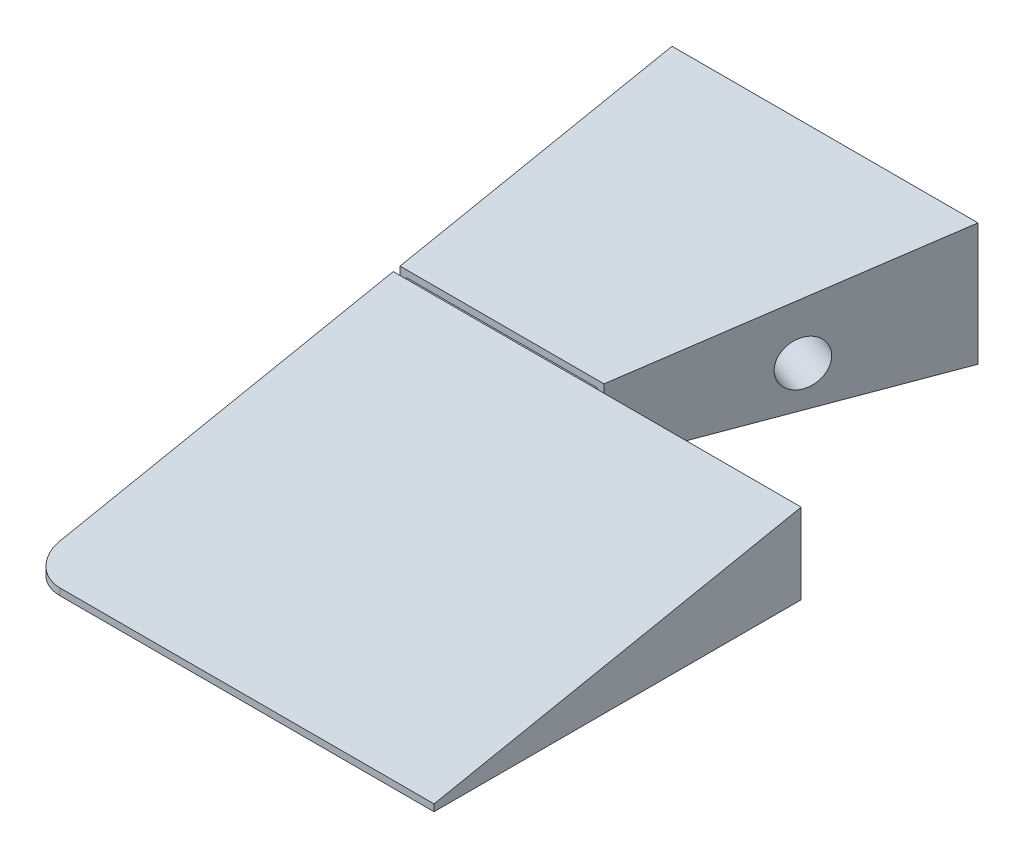
ISO-10303-21;
HEADER;
FILE_DESCRIPTION(('STEP AP214'),'2;1');
FILE_NAME('part.step','',(''),(''),'','','');
FILE_SCHEMA(('AUTOMOTIVE_DESIGN { 1 0 10303 214 1 1 1 1 }'));
ENDSEC;
DATA;
#1=APPLICATION_CONTEXT('core data for automotive mechanical design processes');
#2=APPLICATION_PROTOCOL_DEFINITION('international standard','automotive_design',2000,#1);
#3=PRODUCT_CONTEXT('',#1,'mechanical');
#4=PRODUCT('Part','Part','',(#3));
#5=PRODUCT_RELATED_PRODUCT_CATEGORY('part','',(#4));
#6=PRODUCT_DEFINITION_FORMATION('','',#4);
#7=PRODUCT_DEFINITION_CONTEXT('part definition',#1,'design');
#8=PRODUCT_DEFINITION('design','',#6,#7);
#9=PRODUCT_DEFINITION_SHAPE('','',#8);
#10=(LENGTH_UNIT() NAMED_UNIT(*) SI_UNIT(.MILLI.,.METRE.));
#11=(NAMED_UNIT(*) PLANE_ANGLE_UNIT() SI_UNIT($,.RADIAN.));
#12=(NAMED_UNIT(*) SI_UNIT($,.STERADIAN.) SOLID_ANGLE_UNIT());
#13=UNCERTAINTY_MEASURE_WITH_UNIT(LENGTH_MEASURE(1.E-05),#10,'distance_accuracy_value','');
#14=(GEOMETRIC_REPRESENTATION_CONTEXT(3) GLOBAL_UNCERTAINTY_ASSIGNED_CONTEXT((#13)) GLOBAL_UNIT_ASSIGNED_CONTEXT((#10,
#11,#12)) REPRESENTATION_CONTEXT('',''));
#15=CARTESIAN_POINT('',(0.,0.,0.));
#16=DIRECTION('',(0.,0.,1.));
#17=DIRECTION('',(1.,0.,0.));
#18=AXIS2_PLACEMENT_3D('',#15,#16,#17);
#19=CARTESIAN_POINT('',(-35.,-10.001,41.));
#20=DIRECTION('',(0.,0.,1.));
#21=DIRECTION('',(1.,0.,0.));
#22=AXIS2_PLACEMENT_3D('',#19,#20,#21);
#23=PLANE('',#22);
#24=DIRECTION('',(-1.,0.,0.));
#25=VECTOR('',#24,1.);
#26=CARTESIAN_POINT('',(-35.,-10.,41.));
#27=LINE('',#26,#25);
#28=CARTESIAN_POINT('',(-5.00000000000005,-10.,41.));
#29=VERTEX_POINT('',#28);
#30=CARTESIAN_POINT('',(-65.,-10.,41.));
#31=VERTEX_POINT('',#30);
#32=EDGE_CURVE('E228',#29,#31,#27,.T.);
#33=ORIENTED_EDGE('',*,*,#32,.T.);
#34=DIRECTION('',(0.,1.,0.));
#35=VECTOR('',#34,1.);
#36=CARTESIAN_POINT('',(-65.,1.8,41.));
#37=LINE('',#36,#35);
#38=CARTESIAN_POINT('',(-65.,1.8,41.));
#39=VERTEX_POINT('',#38);
#40=EDGE_CURVE('E185',#31,#39,#37,.T.);
#41=ORIENTED_EDGE('',*,*,#40,.T.);
#42=DIRECTION('',(-1.,0.,0.));
#43=VECTOR('',#42,1.);
#44=CARTESIAN_POINT('',(-35.,1.8,41.));
#45=LINE('',#44,#43);
#46=CARTESIAN_POINT('',(-5.00000000000005,1.8,41.));
#47=VERTEX_POINT('',#46);
#48=EDGE_CURVE('E237',#47,#39,#45,.T.);
#49=ORIENTED_EDGE('',*,*,#48,.F.);
#50=DIRECTION('',(0.,1.,0.));
#51=VECTOR('',#50,1.);
#52=CARTESIAN_POINT('',(-5.00000000000005,-10.001,41.));
#53=LINE('',#52,#51);
#54=EDGE_CURVE('E224',#29,#47,#53,.T.);
#55=ORIENTED_EDGE('',*,*,#54,.F.);
#56=EDGE_LOOP('',(#33,#41,#49,#55));
#57=FACE_BOUND('',#56,.T.);
#58=DIRECTION('',(0.,1.,0.));
#59=VECTOR('',#58,1.);
#60=CARTESIAN_POINT('',(-36.,1.00000000000001,41.));
#61=LINE('',#60,#59);
#62=CARTESIAN_POINT('',(-36.,-7.,41.));
#63=VERTEX_POINT('',#62);
#64=CARTESIAN_POINT('',(-36.,1.00000000000001,41.));
#65=VERTEX_POINT('',#64);
#66=EDGE_CURVE('E56',#63,#65,#61,.T.);
#67=ORIENTED_EDGE('',*,*,#66,.T.);
#68=DIRECTION('',(-1.,0.,0.));
#69=VECTOR('',#68,1.);
#70=CARTESIAN_POINT('',(-64.,1.00000000000001,41.));
#71=LINE('',#70,#69);
#72=CARTESIAN_POINT('',(-64.,1.00000000000001,41.));
#73=VERTEX_POINT('',#72);
#74=EDGE_CURVE('E208',#65,#73,#71,.T.);
#75=ORIENTED_EDGE('',*,*,#74,.T.);
#76=DIRECTION('',(0.,-1.,0.));
#77=VECTOR('',#76,1.);
#78=CARTESIAN_POINT('',(-64.,1.00000000000001,41.));
#79=LINE('',#78,#77);
#80=CARTESIAN_POINT('',(-64.,-7.,41.));
#81=VERTEX_POINT('',#80);
#82=EDGE_CURVE('E210',#73,#81,#79,.T.);
#83=ORIENTED_EDGE('',*,*,#82,.T.);
#84=DIRECTION('',(1.,0.,0.));
#85=VECTOR('',#84,1.);
#86=CARTESIAN_POINT('',(-64.,-7.,41.));
#87=LINE('',#86,#85);
#88=EDGE_CURVE('E162',#81,#63,#87,.T.);
#89=ORIENTED_EDGE('',*,*,#88,.T.);
#90=EDGE_LOOP('',(#67,#75,#83,#89));
#91=FACE_BOUND('',#90,.T.);
#92=ADVANCED_FACE('F34',(#57,#91),#23,.F.);
#93=CARTESIAN_POINT('',(-5.00000000000005,-10.001,41.));
#94=DIRECTION('',(-1.,0.,0.));
#95=DIRECTION('',(0.,0.,1.));
#96=AXIS2_PLACEMENT_3D('',#93,#94,#95);
#97=PLANE('',#96);
#98=DIRECTION('',(0.,0.196116135138184,-0.98058067569092));
#99=VECTOR('',#98,1.);
#100=CARTESIAN_POINT('',(-5.00000000000004,1.34611538461539,43.2694230769231));
#101=LINE('',#100,#99);
#102=CARTESIAN_POINT('',(-5.,-9.,95.));
#103=VERTEX_POINT('',#102);
#104=EDGE_CURVE('E216',#103,#47,#101,.T.);
#105=ORIENTED_EDGE('',*,*,#104,.F.);
#106=DIRECTION('',(0.,1.,0.));
#107=VECTOR('',#106,1.);
#108=CARTESIAN_POINT('',(-5.,-10.001,95.));
#109=LINE('',#108,#107);
#110=CARTESIAN_POINT('',(-5.,-10.,95.));
#111=VERTEX_POINT('',#110);
#112=EDGE_CURVE('E225',#111,#103,#109,.T.);
#113=ORIENTED_EDGE('',*,*,#112,.F.);
#114=DIRECTION('',(0.,0.,-1.));
#115=VECTOR('',#114,1.);
#116=CARTESIAN_POINT('',(-5.00000000000005,-10.,41.));
#117=LINE('',#116,#115);
#118=EDGE_CURVE('E221',#111,#29,#117,.T.);
#119=ORIENTED_EDGE('',*,*,#118,.T.);
#120=ORIENTED_EDGE('',*,*,#54,.T.);
#121=EDGE_LOOP('',(#105,#113,#119,#120));
#122=FACE_BOUND('',#121,.T.);
#123=ADVANCED_FACE('F270',(#122),#97,.F.);
#124=CARTESIAN_POINT('',(0.,0.,95.));
#125=DIRECTION('',(0.,0.,1.));
#126=DIRECTION('',(1.,0.,0.));
#127=AXIS2_PLACEMENT_3D('',#124,#125,#126);
#128=PLANE('',#127);
#129=DIRECTION('',(1.,0.,0.));
#130=VECTOR('',#129,1.);
#131=CARTESIAN_POINT('',(-263.908902631417,-9.,95.));
#132=LINE('',#131,#130);
#133=CARTESIAN_POINT('',(-60.,-9.,95.));
#134=VERTEX_POINT('',#133);
#135=EDGE_CURVE('E214',#134,#103,#132,.T.);
#136=ORIENTED_EDGE('',*,*,#135,.F.);
#137=DIRECTION('',(0.,-1.,0.));
#138=VECTOR('',#137,1.);
#139=CARTESIAN_POINT('',(-60.,-10.,95.));
#140=LINE('',#139,#138);
#141=CARTESIAN_POINT('',(-60.,-10.,95.));
#142=VERTEX_POINT('',#141);
#143=EDGE_CURVE('E240',#134,#142,#140,.T.);
#144=ORIENTED_EDGE('',*,*,#143,.T.);
#145=DIRECTION('',(1.,0.,0.));
#146=VECTOR('',#145,1.);
#147=CARTESIAN_POINT('',(-65.,-10.,95.));
#148=LINE('',#147,#146);
#149=EDGE_CURVE('E232',#142,#111,#148,.T.);
#150=ORIENTED_EDGE('',*,*,#149,.T.);
#151=ORIENTED_EDGE('',*,*,#112,.T.);
#152=EDGE_LOOP('',(#136,#144,#150,#151));
#153=FACE_BOUND('',#152,.T.);
#154=ADVANCED_FACE('F257',(#153),#128,.T.);
#155=CARTESIAN_POINT('',(-60.,0.,90.));
#156=DIRECTION('',(0.,1.,0.));
#157=DIRECTION('',(0.,0.,1.));
#158=AXIS2_PLACEMENT_3D('',#155,#156,#157);
#159=CYLINDRICAL_SURFACE('',#158,5.);
#160=CARTESIAN_POINT('',(-60.,-8.,90.));
#161=DIRECTION('',(0.,0.98058067569092,0.196116135138184));
#162=DIRECTION('',(0.,0.196116135138184,-0.98058067569092));
#163=AXIS2_PLACEMENT_3D('',#160,#161,#162);
#164=ELLIPSE('',#163,5.09901951359278,5.);
#165=CARTESIAN_POINT('',(-65.,-8.,90.));
#166=VERTEX_POINT('',#165);
#167=EDGE_CURVE('E42',#166,#134,#164,.T.);
#168=ORIENTED_EDGE('',*,*,#167,.F.);
#169=DIRECTION('',(0.,-1.,0.));
#170=VECTOR('',#169,1.);
#171=CARTESIAN_POINT('',(-65.,-9.,90.));
#172=LINE('',#171,#170);
#173=CARTESIAN_POINT('',(-65.,-10.,90.));
#174=VERTEX_POINT('',#173);
#175=EDGE_CURVE('E245',#174,#166,#172,.F.);
#176=ORIENTED_EDGE('',*,*,#175,.F.);
#177=CARTESIAN_POINT('',(-60.,-10.,90.));
#178=DIRECTION('',(0.,1.,0.));
#179=DIRECTION('',(0.,0.,1.));
#180=AXIS2_PLACEMENT_3D('',#177,#178,#179);
#181=CIRCLE('',#180,5.);
#182=EDGE_CURVE('E243',#142,#174,#181,.F.);
#183=ORIENTED_EDGE('',*,*,#182,.F.);
#184=ORIENTED_EDGE('',*,*,#143,.F.);
#185=EDGE_LOOP('',(#168,#176,#183,#184));
#186=FACE_BOUND('',#185,.T.);
#187=ADVANCED_FACE('F36',(#186),#159,.T.);
#188=CARTESIAN_POINT('',(-65.,-10.,95.));
#189=DIRECTION('',(0.,1.,0.));
#190=DIRECTION('',(0.,0.,1.));
#191=AXIS2_PLACEMENT_3D('',#188,#189,#190);
#192=PLANE('',#191);
#193=DIRECTION('',(0.,0.,-1.));
#194=VECTOR('',#193,1.);
#195=CARTESIAN_POINT('',(-65.,-10.,95.));
#196=LINE('',#195,#194);
#197=EDGE_CURVE('E234',#174,#31,#196,.T.);
#198=ORIENTED_EDGE('',*,*,#197,.T.);
#199=ORIENTED_EDGE('',*,*,#32,.F.);
#200=ORIENTED_EDGE('',*,*,#118,.F.);
#201=ORIENTED_EDGE('',*,*,#149,.F.);
#202=ORIENTED_EDGE('',*,*,#182,.T.);
#203=EDGE_LOOP('',(#198,#199,#200,#201,#202));
#204=FACE_BOUND('',#203,.T.);
#205=ADVANCED_FACE('F262',(#204),#192,.F.);
#206=CARTESIAN_POINT('',(-263.908902631417,10.,0.));
#207=DIRECTION('',(0.,0.98058067569092,0.196116135138184));
#208=DIRECTION('',(0.,-0.196116135138184,0.98058067569092));
#209=AXIS2_PLACEMENT_3D('',#206,#207,#208);
#210=PLANE('',#209);
#211=ORIENTED_EDGE('',*,*,#48,.T.);
#212=DIRECTION('',(0.,-0.196116135138184,0.98058067569092));
#213=VECTOR('',#212,1.);
#214=CARTESIAN_POINT('',(-65.,-8.26923076923077,91.3461538461538));
#215=LINE('',#214,#213);
#216=EDGE_CURVE('E219',#39,#166,#215,.T.);
#217=ORIENTED_EDGE('',*,*,#216,.T.);
#218=ORIENTED_EDGE('',*,*,#167,.T.);
#219=ORIENTED_EDGE('',*,*,#135,.T.);
#220=ORIENTED_EDGE('',*,*,#104,.T.);
#221=EDGE_LOOP('',(#211,#217,#218,#219,#220));
#222=FACE_BOUND('',#221,.T.);
#223=ADVANCED_FACE('F250',(#222),#210,.T.);
#224=CARTESIAN_POINT('',(-65.,10.,95.));
#225=DIRECTION('',(1.,0.,0.));
#226=DIRECTION('',(0.,0.,-1.));
#227=AXIS2_PLACEMENT_3D('',#224,#225,#226);
#228=PLANE('',#227);
#229=ORIENTED_EDGE('',*,*,#216,.F.);
#230=ORIENTED_EDGE('',*,*,#40,.F.);
#231=ORIENTED_EDGE('',*,*,#197,.F.);
#232=ORIENTED_EDGE('',*,*,#175,.T.);
#233=EDGE_LOOP('',(#229,#230,#231,#232));
#234=FACE_BOUND('',#233,.T.);
#235=ADVANCED_FACE('F267',(#234),#228,.F.);
#236=CARTESIAN_POINT('',(-36.,1.00000000000001,95.002));
#237=DIRECTION('',(-1.,0.,0.));
#238=DIRECTION('',(0.,0.,1.));
#239=AXIS2_PLACEMENT_3D('',#236,#237,#238);
#240=PLANE('',#239);
#241=ORIENTED_EDGE('',*,*,#66,.F.);
#242=DIRECTION('',(0.,0.,-1.));
#243=VECTOR('',#242,1.);
#244=CARTESIAN_POINT('',(-36.,-7.,95.002));
#245=LINE('',#244,#243);
#246=CARTESIAN_POINT('',(-36.,-7.,40.));
#247=VERTEX_POINT('',#246);
#248=EDGE_CURVE('E191',#63,#247,#245,.T.);
#249=ORIENTED_EDGE('',*,*,#248,.T.);
#250=DIRECTION('',(0.,1.,0.));
#251=VECTOR('',#250,1.);
#252=CARTESIAN_POINT('',(-36.,1.00000000000001,40.));
#253=LINE('',#252,#251);
#254=CARTESIAN_POINT('',(-36.,1.00000000000001,40.));
#255=VERTEX_POINT('',#254);
#256=EDGE_CURVE('E182',#247,#255,#253,.T.);
#257=ORIENTED_EDGE('',*,*,#256,.T.);
#258=DIRECTION('',(0.,0.,-1.));
#259=VECTOR('',#258,1.);
#260=CARTESIAN_POINT('',(-36.,1.00000000000001,95.002));
#261=LINE('',#260,#259);
#262=EDGE_CURVE('E196',#65,#255,#261,.T.);
#263=ORIENTED_EDGE('',*,*,#262,.F.);
#264=EDGE_LOOP('',(#241,#249,#257,#263));
#265=FACE_BOUND('',#264,.T.);
#266=ADVANCED_FACE('F284',(#265),#240,.F.);
#267=CARTESIAN_POINT('',(-64.,1.00000000000001,95.002));
#268=DIRECTION('',(0.,-1.,0.));
#269=DIRECTION('',(0.,0.,-1.));
#270=AXIS2_PLACEMENT_3D('',#267,#268,#269);
#271=PLANE('',#270);
#272=ORIENTED_EDGE('',*,*,#74,.F.);
#273=ORIENTED_EDGE('',*,*,#262,.T.);
#274=DIRECTION('',(-1.,0.,0.));
#275=VECTOR('',#274,1.);
#276=CARTESIAN_POINT('',(-64.,1.00000000000001,40.));
#277=LINE('',#276,#275);
#278=CARTESIAN_POINT('',(-64.,1.00000000000001,40.));
#279=VERTEX_POINT('',#278);
#280=EDGE_CURVE('E187',#255,#279,#277,.T.);
#281=ORIENTED_EDGE('',*,*,#280,.T.);
#282=DIRECTION('',(0.,0.,-1.));
#283=VECTOR('',#282,1.);
#284=CARTESIAN_POINT('',(-64.,1.00000000000001,95.002));
#285=LINE('',#284,#283);
#286=EDGE_CURVE('E199',#73,#279,#285,.T.);
#287=ORIENTED_EDGE('',*,*,#286,.F.);
#288=EDGE_LOOP('',(#272,#273,#281,#287));
#289=FACE_BOUND('',#288,.T.);
#290=ADVANCED_FACE('F290',(#289),#271,.F.);
#291=CARTESIAN_POINT('',(-64.,1.00000000000001,95.002));
#292=DIRECTION('',(1.,0.,0.));
#293=DIRECTION('',(0.,0.,-1.));
#294=AXIS2_PLACEMENT_3D('',#291,#292,#293);
#295=PLANE('',#294);
#296=ORIENTED_EDGE('',*,*,#82,.F.);
#297=ORIENTED_EDGE('',*,*,#286,.T.);
#298=DIRECTION('',(0.,-1.,0.));
#299=VECTOR('',#298,1.);
#300=CARTESIAN_POINT('',(-64.,1.00000000000001,40.));
#301=LINE('',#300,#299);
#302=CARTESIAN_POINT('',(-64.,-7.,40.));
#303=VERTEX_POINT('',#302);
#304=EDGE_CURVE('E190',#279,#303,#301,.T.);
#305=ORIENTED_EDGE('',*,*,#304,.T.);
#306=DIRECTION('',(0.,0.,-1.));
#307=VECTOR('',#306,1.);
#308=CARTESIAN_POINT('',(-64.,-7.,95.002));
#309=LINE('',#308,#307);
#310=EDGE_CURVE('E202',#81,#303,#309,.T.);
#311=ORIENTED_EDGE('',*,*,#310,.F.);
#312=EDGE_LOOP('',(#296,#297,#305,#311));
#313=FACE_BOUND('',#312,.T.);
#314=ADVANCED_FACE('F294',(#313),#295,.F.);
#315=CARTESIAN_POINT('',(-64.,-7.,95.002));
#316=DIRECTION('',(0.,1.,0.));
#317=DIRECTION('',(0.,0.,1.));
#318=AXIS2_PLACEMENT_3D('',#315,#316,#317);
#319=PLANE('',#318);
#320=ORIENTED_EDGE('',*,*,#88,.F.);
#321=ORIENTED_EDGE('',*,*,#310,.T.);
#322=DIRECTION('',(1.,0.,0.));
#323=VECTOR('',#322,1.);
#324=CARTESIAN_POINT('',(-64.,-7.,40.));
#325=LINE('',#324,#323);
#326=EDGE_CURVE('E186',#303,#247,#325,.T.);
#327=ORIENTED_EDGE('',*,*,#326,.T.);
#328=ORIENTED_EDGE('',*,*,#248,.F.);
#329=EDGE_LOOP('',(#320,#321,#327,#328));
#330=FACE_BOUND('',#329,.T.);
#331=ADVANCED_FACE('F285',(#330),#319,.F.);
#332=CARTESIAN_POINT('',(-65.,10.,95.));
#333=DIRECTION('',(1.,0.,0.));
#334=DIRECTION('',(0.,0.,-1.));
#335=AXIS2_PLACEMENT_3D('',#332,#333,#334);
#336=PLANE('',#335);
#337=CARTESIAN_POINT('',(-65.,-2.,20.));
#338=DIRECTION('',(-1.,0.,0.));
#339=DIRECTION('',(0.,0.,1.));
#340=AXIS2_PLACEMENT_3D('',#337,#338,#339);
#341=CIRCLE('',#340,3.28999849999999);
#342=CARTESIAN_POINT('',(-65.,-2.,23.2899985));
#343=VERTEX_POINT('',#342);
#344=EDGE_CURVE('E169',#343,#343,#341,.T.);
#345=ORIENTED_EDGE('',*,*,#344,.F.);
#346=EDGE_LOOP('',(#345));
#347=FACE_BOUND('',#346,.T.);
#348=DIRECTION('',(0.,-1.,0.));
#349=VECTOR('',#348,1.);
#350=CARTESIAN_POINT('',(-65.,10.,0.));
#351=LINE('',#350,#349);
#352=CARTESIAN_POINT('',(-65.,10.,0.));
#353=VERTEX_POINT('',#352);
#354=CARTESIAN_POINT('',(-65.,-8.,0.));
#355=VERTEX_POINT('',#354);
#356=EDGE_CURVE('E146',#353,#355,#351,.T.);
#357=ORIENTED_EDGE('',*,*,#356,.T.);
#358=DIRECTION('',(0.,0.,-1.));
#359=VECTOR('',#358,1.);
#360=CARTESIAN_POINT('',(-65.,-8.,41.));
#361=LINE('',#360,#359);
#362=CARTESIAN_POINT('',(-65.,-8.,40.));
#363=VERTEX_POINT('',#362);
#364=EDGE_CURVE('E132',#363,#355,#361,.T.);
#365=ORIENTED_EDGE('',*,*,#364,.F.);
#366=DIRECTION('',(0.,-1.,0.));
#367=VECTOR('',#366,1.);
#368=CARTESIAN_POINT('',(-65.,-10.,40.));
#369=LINE('',#368,#367);
#370=CARTESIAN_POINT('',(-65.,2.,40.));
#371=VERTEX_POINT('',#370);
#372=EDGE_CURVE('E163',#371,#363,#369,.T.);
#373=ORIENTED_EDGE('',*,*,#372,.F.);
#374=DIRECTION('',(0.,-0.196116135138184,0.98058067569092));
#375=VECTOR('',#374,1.);
#376=CARTESIAN_POINT('',(-65.,-8.26923076923077,91.3461538461538));
#377=LINE('',#376,#375);
#378=EDGE_CURVE('E152',#353,#371,#377,.T.);
#379=ORIENTED_EDGE('',*,*,#378,.F.);
#380=EDGE_LOOP('',(#357,#365,#373,#379));
#381=FACE_BOUND('',#380,.T.);
#382=ADVANCED_FACE('F150',(#347,#381),#336,.F.);
#383=CARTESIAN_POINT('',(-35.,-10.001,40.));
#384=DIRECTION('',(0.936329177569045,0.,0.351123441588392));
#385=DIRECTION('',(0.351123441588392,0.,-0.936329177569045));
#386=AXIS2_PLACEMENT_3D('',#383,#384,#385);
#387=PLANE('',#386);
#388=DIRECTION('',(-0.351123441588392,0.,0.936329177569045));
#389=VECTOR('',#388,1.);
#390=CARTESIAN_POINT('',(-35.,-8.,40.));
#391=LINE('',#390,#389);
#392=CARTESIAN_POINT('',(-20.,-8.,0.));
#393=VERTEX_POINT('',#392);
#394=CARTESIAN_POINT('',(-35.,-8.,40.));
#395=VERTEX_POINT('',#394);
#396=EDGE_CURVE('E49',#393,#395,#391,.T.);
#397=ORIENTED_EDGE('',*,*,#396,.F.);
#398=DIRECTION('',(0.,1.,0.));
#399=VECTOR('',#398,1.);
#400=CARTESIAN_POINT('',(-20.,-10.001,0.));
#401=LINE('',#400,#399);
#402=CARTESIAN_POINT('',(-20.,10.,0.));
#403=VERTEX_POINT('',#402);
#404=EDGE_CURVE('E148',#393,#403,#401,.T.);
#405=ORIENTED_EDGE('',*,*,#404,.T.);
#406=DIRECTION('',(-0.345124094421928,-0.184066183691695,0.920330918458474));
#407=VECTOR('',#406,1.);
#408=CARTESIAN_POINT('',(-35.7623716251985,1.59340179989412,42.0329910005294));
#409=LINE('',#408,#407);
#410=CARTESIAN_POINT('',(-35.,2.,40.));
#411=VERTEX_POINT('',#410);
#412=EDGE_CURVE('E154',#403,#411,#409,.T.);
#413=ORIENTED_EDGE('',*,*,#412,.T.);
#414=DIRECTION('',(0.,1.,0.));
#415=VECTOR('',#414,1.);
#416=CARTESIAN_POINT('',(-35.,-10.001,40.));
#417=LINE('',#416,#415);
#418=EDGE_CURVE('E160',#395,#411,#417,.T.);
#419=ORIENTED_EDGE('',*,*,#418,.F.);
#420=EDGE_LOOP('',(#397,#405,#413,#419));
#421=FACE_BOUND('',#420,.T.);
#422=CARTESIAN_POINT('',(-27.0224688317678,-2.,18.7265835513809));
#423=DIRECTION('',(0.936329177569045,0.,0.351123441588392));
#424=DIRECTION('',(0.351123441588392,0.,-0.936329177569045));
#425=AXIS2_PLACEMENT_3D('',#422,#423,#424);
#426=CIRCLE('',#425,3.28999849999999);
#427=CARTESIAN_POINT('',(-25.8672732356272,-2.,15.6460619616725));
#428=VERTEX_POINT('',#427);
#429=EDGE_CURVE('E175',#428,#428,#426,.T.);
#430=ORIENTED_EDGE('',*,*,#429,.F.);
#431=EDGE_LOOP('',(#430));
#432=FACE_BOUND('',#431,.T.);
#433=ADVANCED_FACE('F300',(#421,#432),#387,.T.);
#434=CARTESIAN_POINT('',(0.,0.,0.));
#435=DIRECTION('',(0.,0.,1.));
#436=DIRECTION('',(1.,0.,0.));
#437=AXIS2_PLACEMENT_3D('',#434,#435,#436);
#438=PLANE('',#437);
#439=ORIENTED_EDGE('',*,*,#404,.F.);
#440=DIRECTION('',(1.,0.,0.));
#441=VECTOR('',#440,1.);
#442=CARTESIAN_POINT('',(-20.,-8.,0.));
#443=LINE('',#442,#441);
#444=EDGE_CURVE('E135',#355,#393,#443,.T.);
#445=ORIENTED_EDGE('',*,*,#444,.F.);
#446=ORIENTED_EDGE('',*,*,#356,.F.);
#447=DIRECTION('',(-1.,0.,0.));
#448=VECTOR('',#447,1.);
#449=CARTESIAN_POINT('',(-65.,10.,0.));
#450=LINE('',#449,#448);
#451=EDGE_CURVE('E158',#403,#353,#450,.T.);
#452=ORIENTED_EDGE('',*,*,#451,.F.);
#453=EDGE_LOOP('',(#439,#445,#446,#452));
#454=FACE_BOUND('',#453,.T.);
#455=ADVANCED_FACE('F144',(#454),#438,.F.);
#456=CARTESIAN_POINT('',(-263.908902631417,10.,0.));
#457=DIRECTION('',(0.,0.98058067569092,0.196116135138184));
#458=DIRECTION('',(0.,-0.196116135138184,0.98058067569092));
#459=AXIS2_PLACEMENT_3D('',#456,#457,#458);
#460=PLANE('',#459);
#461=DIRECTION('',(-1.,0.,0.));
#462=VECTOR('',#461,1.);
#463=CARTESIAN_POINT('',(-4.999,2.,40.));
#464=LINE('',#463,#462);
#465=EDGE_CURVE('E178',#411,#371,#464,.T.);
#466=ORIENTED_EDGE('',*,*,#465,.F.);
#467=ORIENTED_EDGE('',*,*,#412,.F.);
#468=ORIENTED_EDGE('',*,*,#451,.T.);
#469=ORIENTED_EDGE('',*,*,#378,.T.);
#470=EDGE_LOOP('',(#466,#467,#468,#469));
#471=FACE_BOUND('',#470,.T.);
#472=ADVANCED_FACE('F310',(#471),#460,.T.);
#473=CARTESIAN_POINT('',(-55.,-2.,20.));
#474=DIRECTION('',(-1.,0.,0.));
#475=DIRECTION('',(0.,0.,1.));
#476=AXIS2_PLACEMENT_3D('',#473,#474,#475);
#477=CONICAL_SURFACE('',#476,3.28999849999999,1.02974425867665);
#478=CARTESIAN_POINT('',(-53.0231694646903,-2.,20.));
#479=VERTEX_POINT('',#478);
#480=VERTEX_LOOP('',#479);
#481=FACE_BOUND('',#480,.T.);
#482=CARTESIAN_POINT('',(-55.,-2.,20.));
#483=DIRECTION('',(-1.,0.,0.));
#484=DIRECTION('',(0.,0.,1.));
#485=AXIS2_PLACEMENT_3D('',#482,#483,#484);
#486=CIRCLE('',#485,3.28999849999999);
#487=CARTESIAN_POINT('',(-55.,-2.,23.2899985));
#488=VERTEX_POINT('',#487);
#489=EDGE_CURVE('E166',#488,#488,#486,.T.);
#490=ORIENTED_EDGE('',*,*,#489,.T.);
#491=EDGE_LOOP('',(#490));
#492=FACE_BOUND('',#491,.T.);
#493=ADVANCED_FACE('F313',(#481,#492),#477,.F.);
#494=CARTESIAN_POINT('',(-65.,-2.,20.));
#495=DIRECTION('',(-1.,0.,0.));
#496=DIRECTION('',(0.,0.,1.));
#497=AXIS2_PLACEMENT_3D('',#494,#495,#496);
#498=CYLINDRICAL_SURFACE('',#497,3.28999849999999);
#499=ORIENTED_EDGE('',*,*,#489,.F.);
#500=EDGE_LOOP('',(#499));
#501=FACE_BOUND('',#500,.T.);
#502=ORIENTED_EDGE('',*,*,#344,.T.);
#503=EDGE_LOOP('',(#502));
#504=FACE_BOUND('',#503,.T.);
#505=ADVANCED_FACE('F326',(#501,#504),#498,.F.);
#506=CARTESIAN_POINT('',(-36.3857606074583,-2.,15.215349135497));
#507=DIRECTION('',(0.936329177569045,0.,0.351123441588392));
#508=DIRECTION('',(0.351123441588392,0.,-0.936329177569045));
#509=AXIS2_PLACEMENT_3D('',#506,#507,#508);
#510=CONICAL_SURFACE('',#509,3.28999849999999,1.02974425867665);
#511=CARTESIAN_POINT('',(-38.2367247167782,-2.,14.521237594502));
#512=VERTEX_POINT('',#511);
#513=VERTEX_LOOP('',#512);
#514=FACE_BOUND('',#513,.T.);
#515=CARTESIAN_POINT('',(-36.3857606074583,-2.,15.215349135497));
#516=DIRECTION('',(0.936329177569045,0.,0.351123441588392));
#517=DIRECTION('',(0.351123441588392,0.,-0.936329177569045));
#518=AXIS2_PLACEMENT_3D('',#515,#516,#517);
#519=CIRCLE('',#518,3.28999849999999);
#520=CARTESIAN_POINT('',(-35.2305650113176,-2.,12.1348275457886));
#521=VERTEX_POINT('',#520);
#522=EDGE_CURVE('E172',#521,#521,#519,.T.);
#523=ORIENTED_EDGE('',*,*,#522,.T.);
#524=EDGE_LOOP('',(#523));
#525=FACE_BOUND('',#524,.T.);
#526=ADVANCED_FACE('F322',(#514,#525),#510,.F.);
#527=CARTESIAN_POINT('',(-27.0224688317678,-2.,18.7265835513809));
#528=DIRECTION('',(0.936329177569045,0.,0.351123441588392));
#529=DIRECTION('',(0.351123441588392,0.,-0.936329177569045));
#530=AXIS2_PLACEMENT_3D('',#527,#528,#529);
#531=CYLINDRICAL_SURFACE('',#530,3.28999849999999);
#532=ORIENTED_EDGE('',*,*,#522,.F.);
#533=EDGE_LOOP('',(#532));
#534=FACE_BOUND('',#533,.T.);
#535=ORIENTED_EDGE('',*,*,#429,.T.);
#536=EDGE_LOOP('',(#535));
#537=FACE_BOUND('',#536,.T.);
#538=ADVANCED_FACE('F318',(#534,#537),#531,.F.);
#539=CARTESIAN_POINT('',(-4.999,-10.,40.));
#540=DIRECTION('',(0.,0.,-1.));
#541=DIRECTION('',(-1.,0.,0.));
#542=AXIS2_PLACEMENT_3D('',#539,#540,#541);
#543=PLANE('',#542);
#544=ORIENTED_EDGE('',*,*,#256,.F.);
#545=ORIENTED_EDGE('',*,*,#326,.F.);
#546=ORIENTED_EDGE('',*,*,#304,.F.);
#547=ORIENTED_EDGE('',*,*,#280,.F.);
#548=EDGE_LOOP('',(#544,#545,#546,#547));
#549=FACE_BOUND('',#548,.T.);
#550=ORIENTED_EDGE('',*,*,#372,.T.);
#551=DIRECTION('',(1.,0.,0.));
#552=VECTOR('',#551,1.);
#553=CARTESIAN_POINT('',(-4.999,-8.,40.));
#554=LINE('',#553,#552);
#555=EDGE_CURVE('E11',#363,#395,#554,.T.);
#556=ORIENTED_EDGE('',*,*,#555,.T.);
#557=ORIENTED_EDGE('',*,*,#418,.T.);
#558=ORIENTED_EDGE('',*,*,#465,.T.);
#559=EDGE_LOOP('',(#550,#556,#557,#558));
#560=FACE_BOUND('',#559,.T.);
#561=ADVANCED_FACE('F315',(#549,#560),#543,.F.);
#562=CARTESIAN_POINT('',(-20.,-8.,41.));
#563=DIRECTION('',(0.,1.,0.));
#564=DIRECTION('',(-1.,0.,0.));
#565=AXIS2_PLACEMENT_3D('',#562,#563,#564);
#566=PLANE('',#565);
#567=ORIENTED_EDGE('',*,*,#396,.T.);
#568=ORIENTED_EDGE('',*,*,#555,.F.);
#569=ORIENTED_EDGE('',*,*,#364,.T.);
#570=ORIENTED_EDGE('',*,*,#444,.T.);
#571=EDGE_LOOP('',(#567,#568,#569,#570));
#572=FACE_BOUND('',#571,.T.);
#573=ADVANCED_FACE('F134',(#572),#566,.F.);
#574=CLOSED_SHELL('',(#92,#123,#154,#187,#205,#223,#235,#266,#290,#314,#331,#382,#433,#455,#472,
#493,#505,#526,#538,#561,#573));
#575=MANIFOLD_SOLID_BREP('B2',#574);
#576=ADVANCED_BREP_SHAPE_REPRESENTATION('',(#18,#575),#14);
#577=SHAPE_DEFINITION_REPRESENTATION(#9,#576);
ENDSEC;
END-ISO-10303-21;
